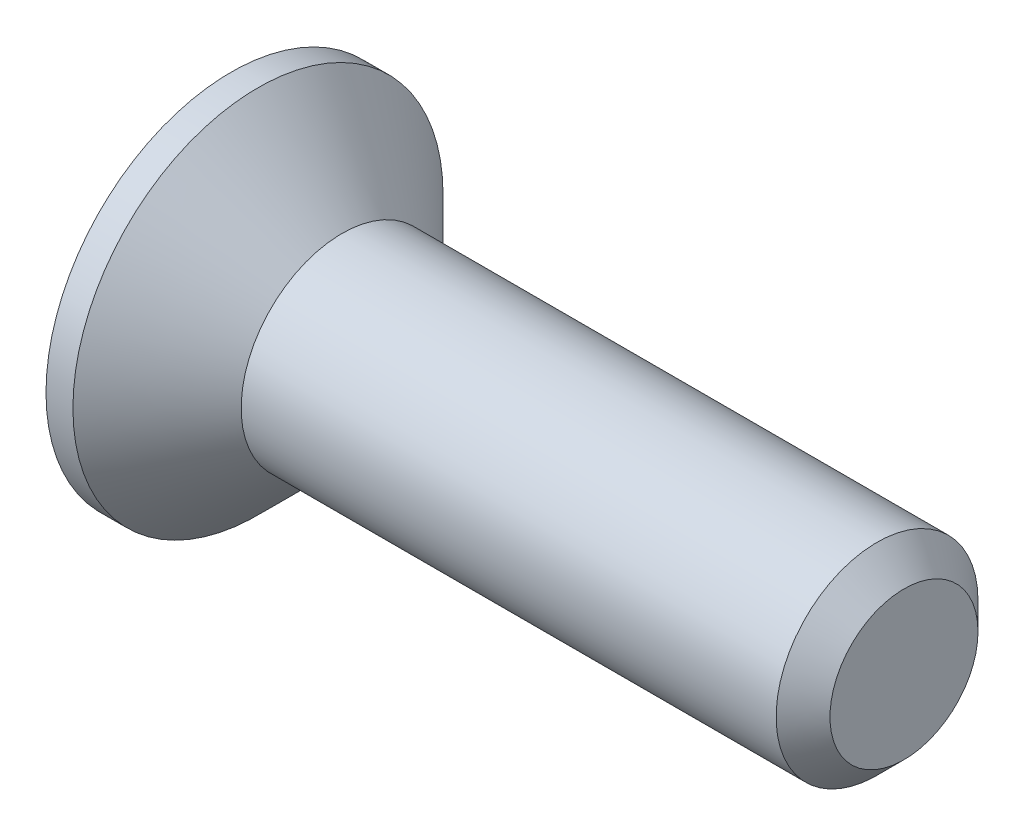
ISO-10303-21;
HEADER;
FILE_DESCRIPTION(('STEP AP214'),'2;1');
FILE_NAME('part.step','',(''),(''),'','','');
FILE_SCHEMA(('AUTOMOTIVE_DESIGN { 1 0 10303 214 1 1 1 1 }'));
ENDSEC;
DATA;
#1=APPLICATION_CONTEXT('core data for automotive mechanical design processes');
#2=APPLICATION_PROTOCOL_DEFINITION('international standard','automotive_design',2000,#1);
#3=PRODUCT_CONTEXT('',#1,'mechanical');
#4=PRODUCT('Part','Part','',(#3));
#5=PRODUCT_RELATED_PRODUCT_CATEGORY('part','',(#4));
#6=PRODUCT_DEFINITION_FORMATION('','',#4);
#7=PRODUCT_DEFINITION_CONTEXT('part definition',#1,'design');
#8=PRODUCT_DEFINITION('design','',#6,#7);
#9=PRODUCT_DEFINITION_SHAPE('','',#8);
#10=(LENGTH_UNIT() NAMED_UNIT(*) SI_UNIT(.MILLI.,.METRE.));
#11=(NAMED_UNIT(*) PLANE_ANGLE_UNIT() SI_UNIT($,.RADIAN.));
#12=(NAMED_UNIT(*) SI_UNIT($,.STERADIAN.) SOLID_ANGLE_UNIT());
#13=UNCERTAINTY_MEASURE_WITH_UNIT(LENGTH_MEASURE(1.E-05),#10,'distance_accuracy_value','');
#14=(GEOMETRIC_REPRESENTATION_CONTEXT(3) GLOBAL_UNCERTAINTY_ASSIGNED_CONTEXT((#13)) GLOBAL_UNIT_ASSIGNED_CONTEXT((#10,
#11,#12)) REPRESENTATION_CONTEXT('',''));
#15=CARTESIAN_POINT('',(0.,0.,0.));
#16=DIRECTION('',(0.,0.,1.));
#17=DIRECTION('',(1.,0.,0.));
#18=AXIS2_PLACEMENT_3D('',#15,#16,#17);
#19=CARTESIAN_POINT('',(48.1847927934104,0.,0.));
#20=DIRECTION('',(1.,0.,0.));
#21=DIRECTION('',(0.,0.,-1.));
#22=AXIS2_PLACEMENT_3D('',#19,#20,#21);
#23=CYLINDRICAL_SURFACE('',#22,1.49999999999999);
#24=CARTESIAN_POINT('',(-4.21273268597435,0.,0.));
#25=DIRECTION('',(1.,0.,0.));
#26=DIRECTION('',(0.,0.,-1.));
#27=AXIS2_PLACEMENT_3D('',#24,#25,#26);
#28=CIRCLE('',#27,1.49999999999999);
#29=CARTESIAN_POINT('',(-4.21273268597435,0.,-1.49999999999999));
#30=VERTEX_POINT('',#29);
#31=EDGE_CURVE('E205',#30,#30,#28,.T.);
#32=ORIENTED_EDGE('',*,*,#31,.T.);
#33=EDGE_LOOP('',(#32));
#34=FACE_BOUND('',#33,.T.);
#35=CARTESIAN_POINT('',(3.73726731402565,0.,0.));
#36=DIRECTION('',(1.,0.,0.));
#37=DIRECTION('',(0.,0.,-1.));
#38=AXIS2_PLACEMENT_3D('',#35,#36,#37);
#39=CIRCLE('',#38,1.49999999999999);
#40=CARTESIAN_POINT('',(3.73726731402565,0.,-1.49999999999999));
#41=VERTEX_POINT('',#40);
#42=EDGE_CURVE('E245',#41,#41,#39,.T.);
#43=ORIENTED_EDGE('',*,*,#42,.F.);
#44=EDGE_LOOP('',(#43));
#45=FACE_BOUND('',#44,.T.);
#46=ADVANCED_FACE('F35',(#34,#45),#23,.T.);
#47=CARTESIAN_POINT('',(4.13726731402565,0.,0.));
#48=DIRECTION('',(-1.,0.,0.));
#49=DIRECTION('',(0.,0.,1.));
#50=AXIS2_PLACEMENT_3D('',#47,#48,#49);
#51=CONICAL_SURFACE('',#50,1.09999999999999,0.785398163397454);
#52=ORIENTED_EDGE('',*,*,#42,.T.);
#53=EDGE_LOOP('',(#52));
#54=FACE_BOUND('',#53,.T.);
#55=CARTESIAN_POINT('',(4.13726731402565,0.,0.));
#56=DIRECTION('',(1.,0.,0.));
#57=DIRECTION('',(0.,0.,-1.));
#58=AXIS2_PLACEMENT_3D('',#55,#56,#57);
#59=CIRCLE('',#58,1.09999999999999);
#60=CARTESIAN_POINT('',(4.13726731402565,0.,-1.09999999999999));
#61=VERTEX_POINT('',#60);
#62=EDGE_CURVE('E242',#61,#61,#59,.T.);
#63=ORIENTED_EDGE('',*,*,#62,.F.);
#64=EDGE_LOOP('',(#63));
#65=FACE_BOUND('',#64,.T.);
#66=ADVANCED_FACE('F417',(#54,#65),#51,.T.);
#67=CARTESIAN_POINT('',(4.13726731402565,1.09999999999999,0.));
#68=DIRECTION('',(1.,0.,0.));
#69=DIRECTION('',(0.,0.,-1.));
#70=AXIS2_PLACEMENT_3D('',#67,#68,#69);
#71=PLANE('',#70);
#72=ORIENTED_EDGE('',*,*,#62,.T.);
#73=EDGE_LOOP('',(#72));
#74=FACE_BOUND('',#73,.T.);
#75=ADVANCED_FACE('F423',(#74),#71,.T.);
#76=CARTESIAN_POINT('',(-5.86273268597435,2.74999999999999,0.));
#77=DIRECTION('',(-1.,0.,0.));
#78=DIRECTION('',(0.,0.,1.));
#79=AXIS2_PLACEMENT_3D('',#76,#77,#78);
#80=PLANE('',#79);
#81=CARTESIAN_POINT('',(-5.86273268597435,-0.552308794936704,0.95662689429756));
#82=DIRECTION('',(-1.,0.,0.));
#83=DIRECTION('',(0.,0.,1.));
#84=AXIS2_PLACEMENT_3D('',#81,#82,#83);
#85=CIRCLE('',#84,0.345382410126592);
#86=CARTESIAN_POINT('',(-5.86273268597435,-0.309423621714401,1.20217892921809));
#87=VERTEX_POINT('',#86);
#88=CARTESIAN_POINT('',(-5.86273268597435,-0.88640568174002,0.86905818154474));
#89=VERTEX_POINT('',#88);
#90=EDGE_CURVE('E266',#87,#89,#85,.F.);
#91=ORIENTED_EDGE('',*,*,#90,.T.);
#92=CARTESIAN_POINT('',(-5.86273268597435,-1.31202848673343,0.757500000000061));
#93=DIRECTION('',(-1.,0.,0.));
#94=DIRECTION('',(0.,0.,1.));
#95=AXIS2_PLACEMENT_3D('',#92,#93,#94);
#96=CIRCLE('',#95,0.439999999999997);
#97=CARTESIAN_POINT('',(-5.86273268597435,-1.19582930345442,0.333120747673377));
#98=VERTEX_POINT('',#97);
#99=EDGE_CURVE('E270',#89,#98,#96,.T.);
#100=ORIENTED_EDGE('',*,*,#99,.T.);
#101=CARTESIAN_POINT('',(-5.86273268597435,-1.10461758987346,0.));
#102=DIRECTION('',(-1.,0.,0.));
#103=DIRECTION('',(0.,0.,1.));
#104=AXIS2_PLACEMENT_3D('',#101,#102,#103);
#105=CIRCLE('',#104,0.345382410126586);
#106=CARTESIAN_POINT('',(-5.86273268597435,-1.19582930345447,-0.333120747673296));
#107=VERTEX_POINT('',#106);
#108=EDGE_CURVE('E268',#98,#107,#105,.F.);
#109=ORIENTED_EDGE('',*,*,#108,.T.);
#110=CARTESIAN_POINT('',(-5.86273268597435,-1.31202848673348,-0.757499999999909));
#111=DIRECTION('',(-1.,0.,0.));
#112=DIRECTION('',(0.,0.,1.));
#113=AXIS2_PLACEMENT_3D('',#110,#111,#112);
#114=CIRCLE('',#113,0.440000000000004);
#115=CARTESIAN_POINT('',(-5.86273268597435,-0.886405681740116,-0.869058181544649));
#116=VERTEX_POINT('',#115);
#117=EDGE_CURVE('E264',#107,#116,#114,.T.);
#118=ORIENTED_EDGE('',*,*,#117,.T.);
#119=CARTESIAN_POINT('',(-5.86273268597435,-0.552308794936798,-0.956626894297446));
#120=DIRECTION('',(-1.,0.,0.));
#121=DIRECTION('',(0.,0.,1.));
#122=AXIS2_PLACEMENT_3D('',#119,#120,#121);
#123=CIRCLE('',#122,0.345382410126588);
#124=CARTESIAN_POINT('',(-5.86273268597435,-0.30942362171449,-1.20217892921801));
#125=VERTEX_POINT('',#124);
#126=EDGE_CURVE('E260',#116,#125,#123,.F.);
#127=ORIENTED_EDGE('',*,*,#126,.T.);
#128=CARTESIAN_POINT('',(-5.86273268597435,-1.05343337566385E-13,-1.51499999999994));
#129=DIRECTION('',(-1.,0.,0.));
#130=DIRECTION('',(0.,0.,1.));
#131=AXIS2_PLACEMENT_3D('',#128,#129,#130);
#132=CIRCLE('',#131,0.440000000000001);
#133=CARTESIAN_POINT('',(-5.86273268597435,0.309423621714345,-1.20217892921803));
#134=VERTEX_POINT('',#133);
#135=EDGE_CURVE('E256',#125,#134,#132,.T.);
#136=ORIENTED_EDGE('',*,*,#135,.T.);
#137=CARTESIAN_POINT('',(-5.86273268597435,0.552308794936677,-0.956626894297546));
#138=DIRECTION('',(-1.,0.,0.));
#139=DIRECTION('',(0.,0.,1.));
#140=AXIS2_PLACEMENT_3D('',#137,#138,#139);
#141=CIRCLE('',#140,0.34538241012656);
#142=CARTESIAN_POINT('',(-5.86273268597435,0.886405681739925,-0.869058181544674));
#143=VERTEX_POINT('',#142);
#144=EDGE_CURVE('E252',#134,#143,#141,.F.);
#145=ORIENTED_EDGE('',*,*,#144,.T.);
#146=CARTESIAN_POINT('',(-5.86273268597435,1.31202848673332,-0.757500000000001));
#147=DIRECTION('',(-1.,0.,0.));
#148=DIRECTION('',(0.,0.,1.));
#149=AXIS2_PLACEMENT_3D('',#146,#147,#148);
#150=CIRCLE('',#149,0.44);
#151=CARTESIAN_POINT('',(-5.86273268597435,1.19582930345433,-0.333120747673387));
#152=VERTEX_POINT('',#151);
#153=EDGE_CURVE('E248',#143,#152,#150,.T.);
#154=ORIENTED_EDGE('',*,*,#153,.T.);
#155=CARTESIAN_POINT('',(-5.86273268597435,1.10461758987334,0.));
#156=DIRECTION('',(-1.,0.,0.));
#157=DIRECTION('',(0.,0.,1.));
#158=AXIS2_PLACEMENT_3D('',#155,#156,#157);
#159=CIRCLE('',#158,0.345382410126588);
#160=CARTESIAN_POINT('',(-5.86273268597435,1.19582930345436,0.333120747673347));
#161=VERTEX_POINT('',#160);
#162=EDGE_CURVE('E250',#152,#161,#159,.F.);
#163=ORIENTED_EDGE('',*,*,#162,.T.);
#164=CARTESIAN_POINT('',(-5.86273268597435,1.31202848673337,0.757499999999969));
#165=DIRECTION('',(-1.,0.,0.));
#166=DIRECTION('',(0.,0.,1.));
#167=AXIS2_PLACEMENT_3D('',#164,#165,#166);
#168=CIRCLE('',#167,0.439999999999988);
#169=CARTESIAN_POINT('',(-5.86273268597435,0.886405681739998,0.869058181544673));
#170=VERTEX_POINT('',#169);
#171=EDGE_CURVE('E254',#161,#170,#168,.T.);
#172=ORIENTED_EDGE('',*,*,#171,.T.);
#173=CARTESIAN_POINT('',(-5.86273268597435,0.552308794936693,0.956626894297506));
#174=DIRECTION('',(-1.,0.,0.));
#175=DIRECTION('',(0.,0.,1.));
#176=AXIS2_PLACEMENT_3D('',#173,#174,#175);
#177=CIRCLE('',#176,0.3453824101266);
#178=CARTESIAN_POINT('',(-5.86273268597435,0.309423621714385,1.20217892921807));
#179=VERTEX_POINT('',#178);
#180=EDGE_CURVE('E258',#170,#179,#177,.F.);
#181=ORIENTED_EDGE('',*,*,#180,.T.);
#182=CARTESIAN_POINT('',(-5.86273268597435,0.,1.515));
#183=DIRECTION('',(-1.,0.,0.));
#184=DIRECTION('',(0.,0.,1.));
#185=AXIS2_PLACEMENT_3D('',#182,#183,#184);
#186=CIRCLE('',#185,0.439999999999998);
#187=EDGE_CURVE('E262',#179,#87,#186,.T.);
#188=ORIENTED_EDGE('',*,*,#187,.T.);
#189=EDGE_LOOP('',(#91,#100,#109,#118,#127,#136,#145,#154,#163,#172,#181,#188));
#190=FACE_BOUND('',#189,.T.);
#191=CARTESIAN_POINT('',(-5.86273268597435,0.,0.));
#192=DIRECTION('',(1.,0.,0.));
#193=DIRECTION('',(0.,0.,-1.));
#194=AXIS2_PLACEMENT_3D('',#191,#192,#193);
#195=CIRCLE('',#194,2.74999999999999);
#196=CARTESIAN_POINT('',(-5.86273268597435,0.,-2.74999999999999));
#197=VERTEX_POINT('',#196);
#198=EDGE_CURVE('E239',#197,#197,#195,.T.);
#199=ORIENTED_EDGE('',*,*,#198,.F.);
#200=EDGE_LOOP('',(#199));
#201=FACE_BOUND('',#200,.T.);
#202=ADVANCED_FACE('F334',(#190,#201),#80,.T.);
#203=CARTESIAN_POINT('',(48.1847927934104,0.,0.));
#204=DIRECTION('',(1.,0.,0.));
#205=DIRECTION('',(0.,0.,-1.));
#206=AXIS2_PLACEMENT_3D('',#203,#204,#205);
#207=CYLINDRICAL_SURFACE('',#206,2.74999999999999);
#208=ORIENTED_EDGE('',*,*,#198,.T.);
#209=EDGE_LOOP('',(#208));
#210=FACE_BOUND('',#209,.T.);
#211=CARTESIAN_POINT('',(-5.46273268597437,0.,0.));
#212=DIRECTION('',(1.,0.,0.));
#213=DIRECTION('',(0.,0.,-1.));
#214=AXIS2_PLACEMENT_3D('',#211,#212,#213);
#215=CIRCLE('',#214,2.74999999999999);
#216=CARTESIAN_POINT('',(-5.46273268597437,0.,-2.74999999999999));
#217=VERTEX_POINT('',#216);
#218=EDGE_CURVE('E236',#217,#217,#215,.T.);
#219=ORIENTED_EDGE('',*,*,#218,.F.);
#220=EDGE_LOOP('',(#219));
#221=FACE_BOUND('',#220,.T.);
#222=ADVANCED_FACE('F654',(#210,#221),#207,.T.);
#223=CARTESIAN_POINT('',(-4.21273268597435,0.,0.));
#224=DIRECTION('',(-1.,0.,0.));
#225=DIRECTION('',(0.,0.,1.));
#226=AXIS2_PLACEMENT_3D('',#223,#224,#225);
#227=CONICAL_SURFACE('',#226,1.49999999999999,0.785398163397442);
#228=ORIENTED_EDGE('',*,*,#218,.T.);
#229=EDGE_LOOP('',(#228));
#230=FACE_BOUND('',#229,.T.);
#231=ORIENTED_EDGE('',*,*,#31,.F.);
#232=EDGE_LOOP('',(#231));
#233=FACE_BOUND('',#232,.T.);
#234=ADVANCED_FACE('F647',(#230,#233),#227,.T.);
#235=CARTESIAN_POINT('',(-5.03273268597435,1.10461758987334,0.));
#236=DIRECTION('',(-1.,0.,0.));
#237=DIRECTION('',(0.,0.,1.));
#238=AXIS2_PLACEMENT_3D('',#235,#236,#237);
#239=CYLINDRICAL_SURFACE('',#238,0.295382410126597);
#240=DIRECTION('',(-1.,0.,0.));
#241=VECTOR('',#240,1.);
#242=CARTESIAN_POINT('',(-5.03273268597435,1.18262485080903,0.284895832636267));
#243=LINE('',#242,#241);
#244=CARTESIAN_POINT('',(-5.03273268597435,1.18262485080903,0.284895832636267));
#245=VERTEX_POINT('',#244);
#246=CARTESIAN_POINT('',(-5.81273268597436,1.18262485080903,0.284895832636267));
#247=VERTEX_POINT('',#246);
#248=EDGE_CURVE('E203',#245,#247,#243,.T.);
#249=ORIENTED_EDGE('',*,*,#248,.T.);
#250=CARTESIAN_POINT('',(-5.81273268597436,1.10461758987334,0.));
#251=DIRECTION('',(-1.,0.,0.));
#252=DIRECTION('',(0.,0.,1.));
#253=AXIS2_PLACEMENT_3D('',#250,#251,#252);
#254=CIRCLE('',#253,0.295382410126597);
#255=CARTESIAN_POINT('',(-5.81273268597436,1.182624850809,-0.28489583263628));
#256=VERTEX_POINT('',#255);
#257=EDGE_CURVE('E45',#247,#256,#254,.T.);
#258=ORIENTED_EDGE('',*,*,#257,.T.);
#259=DIRECTION('',(-1.,0.,0.));
#260=VECTOR('',#259,1.);
#261=CARTESIAN_POINT('',(-5.03273268597435,1.182624850809,-0.28489583263628));
#262=LINE('',#261,#260);
#263=CARTESIAN_POINT('',(-5.03273268597435,1.182624850809,-0.28489583263628));
#264=VERTEX_POINT('',#263);
#265=EDGE_CURVE('E162',#264,#256,#262,.T.);
#266=ORIENTED_EDGE('',*,*,#265,.F.);
#267=CARTESIAN_POINT('',(-5.03273268597435,1.10461758987334,0.));
#268=DIRECTION('',(-1.,0.,0.));
#269=DIRECTION('',(0.,0.,1.));
#270=AXIS2_PLACEMENT_3D('',#267,#268,#269);
#271=CIRCLE('',#270,0.295382410126597);
#272=EDGE_CURVE('E169',#245,#264,#271,.T.);
#273=ORIENTED_EDGE('',*,*,#272,.F.);
#274=EDGE_LOOP('',(#249,#258,#266,#273));
#275=FACE_BOUND('',#274,.T.);
#276=ADVANCED_FACE('F172',(#275),#239,.F.);
#277=CARTESIAN_POINT('',(-5.03273268597435,1.31202848673337,0.757499999999969));
#278=DIRECTION('',(-1.,0.,0.));
#279=DIRECTION('',(0.,0.,1.));
#280=AXIS2_PLACEMENT_3D('',#277,#278,#279);
#281=CYLINDRICAL_SURFACE('',#280,0.489999999999979);
#282=DIRECTION('',(-1.,0.,0.));
#283=VECTOR('',#282,1.);
#284=CARTESIAN_POINT('',(-5.03273268597435,0.838039453899849,0.881735247629296));
#285=LINE('',#284,#283);
#286=CARTESIAN_POINT('',(-5.03273268597435,0.838039453899849,0.881735247629296));
#287=VERTEX_POINT('',#286);
#288=CARTESIAN_POINT('',(-5.81273268597436,0.838039453899849,0.881735247629296));
#289=VERTEX_POINT('',#288);
#290=EDGE_CURVE('E206',#287,#289,#285,.T.);
#291=ORIENTED_EDGE('',*,*,#290,.T.);
#292=CARTESIAN_POINT('',(-5.81273268597436,1.31202848673337,0.757499999999969));
#293=DIRECTION('',(-1.,0.,0.));
#294=DIRECTION('',(0.,0.,1.));
#295=AXIS2_PLACEMENT_3D('',#292,#293,#294);
#296=CIRCLE('',#295,0.489999999999979);
#297=EDGE_CURVE('E290',#289,#247,#296,.F.);
#298=ORIENTED_EDGE('',*,*,#297,.T.);
#299=ORIENTED_EDGE('',*,*,#248,.F.);
#300=CARTESIAN_POINT('',(-5.03273268597435,1.31202848673337,0.757499999999969));
#301=DIRECTION('',(-1.,0.,0.));
#302=DIRECTION('',(0.,0.,1.));
#303=AXIS2_PLACEMENT_3D('',#300,#301,#302);
#304=CIRCLE('',#303,0.489999999999979);
#305=EDGE_CURVE('E173',#245,#287,#304,.T.);
#306=ORIENTED_EDGE('',*,*,#305,.T.);
#307=EDGE_LOOP('',(#291,#298,#299,#306));
#308=FACE_BOUND('',#307,.T.);
#309=ADVANCED_FACE('F403',(#308),#281,.T.);
#310=CARTESIAN_POINT('',(-5.03273268597435,0.552308794936693,0.956626894297506));
#311=DIRECTION('',(-1.,0.,0.));
#312=DIRECTION('',(0.,0.,1.));
#313=AXIS2_PLACEMENT_3D('',#310,#311,#312);
#314=CYLINDRICAL_SURFACE('',#313,0.295382410126609);
#315=DIRECTION('',(-1.,0.,0.));
#316=VECTOR('',#315,1.);
#317=CARTESIAN_POINT('',(-5.03273268597435,0.344585396909195,1.16663108026558));
#318=LINE('',#317,#316);
#319=CARTESIAN_POINT('',(-5.03273268597435,0.344585396909195,1.16663108026558));
#320=VERTEX_POINT('',#319);
#321=CARTESIAN_POINT('',(-5.81273268597436,0.344585396909195,1.16663108026558));
#322=VERTEX_POINT('',#321);
#323=EDGE_CURVE('E209',#320,#322,#318,.T.);
#324=ORIENTED_EDGE('',*,*,#323,.T.);
#325=CARTESIAN_POINT('',(-5.81273268597436,0.552308794936693,0.956626894297506));
#326=DIRECTION('',(-1.,0.,0.));
#327=DIRECTION('',(0.,0.,1.));
#328=AXIS2_PLACEMENT_3D('',#325,#326,#327);
#329=CIRCLE('',#328,0.295382410126609);
#330=EDGE_CURVE('E286',#322,#289,#329,.T.);
#331=ORIENTED_EDGE('',*,*,#330,.T.);
#332=ORIENTED_EDGE('',*,*,#290,.F.);
#333=CARTESIAN_POINT('',(-5.03273268597435,0.552308794936693,0.956626894297506));
#334=DIRECTION('',(-1.,0.,0.));
#335=DIRECTION('',(0.,0.,1.));
#336=AXIS2_PLACEMENT_3D('',#333,#334,#335);
#337=CIRCLE('',#336,0.295382410126609);
#338=EDGE_CURVE('E200',#320,#287,#337,.T.);
#339=ORIENTED_EDGE('',*,*,#338,.F.);
#340=EDGE_LOOP('',(#324,#331,#332,#339));
#341=FACE_BOUND('',#340,.T.);
#342=ADVANCED_FACE('F399',(#341),#314,.F.);
#343=CARTESIAN_POINT('',(-5.03273268597435,0.,1.515));
#344=DIRECTION('',(-1.,0.,0.));
#345=DIRECTION('',(0.,0.,1.));
#346=AXIS2_PLACEMENT_3D('',#343,#344,#345);
#347=CYLINDRICAL_SURFACE('',#346,0.489999999999989);
#348=DIRECTION('',(-1.,0.,0.));
#349=VECTOR('',#348,1.);
#350=CARTESIAN_POINT('',(-5.03273268597435,-0.344585396909213,1.1666310802656));
#351=LINE('',#350,#349);
#352=CARTESIAN_POINT('',(-5.03273268597435,-0.344585396909213,1.1666310802656));
#353=VERTEX_POINT('',#352);
#354=CARTESIAN_POINT('',(-5.81273268597436,-0.344585396909213,1.1666310802656));
#355=VERTEX_POINT('',#354);
#356=EDGE_CURVE('E212',#353,#355,#351,.T.);
#357=ORIENTED_EDGE('',*,*,#356,.T.);
#358=CARTESIAN_POINT('',(-5.81273268597436,0.,1.515));
#359=DIRECTION('',(-1.,0.,0.));
#360=DIRECTION('',(0.,0.,1.));
#361=AXIS2_PLACEMENT_3D('',#358,#359,#360);
#362=CIRCLE('',#361,0.489999999999989);
#363=EDGE_CURVE('E282',#355,#322,#362,.F.);
#364=ORIENTED_EDGE('',*,*,#363,.T.);
#365=ORIENTED_EDGE('',*,*,#323,.F.);
#366=CARTESIAN_POINT('',(-5.03273268597435,0.,1.515));
#367=DIRECTION('',(-1.,0.,0.));
#368=DIRECTION('',(0.,0.,1.));
#369=AXIS2_PLACEMENT_3D('',#366,#367,#368);
#370=CIRCLE('',#369,0.489999999999989);
#371=EDGE_CURVE('E198',#320,#353,#370,.T.);
#372=ORIENTED_EDGE('',*,*,#371,.T.);
#373=EDGE_LOOP('',(#357,#364,#365,#372));
#374=FACE_BOUND('',#373,.T.);
#375=ADVANCED_FACE('F387',(#374),#347,.T.);
#376=CARTESIAN_POINT('',(-5.03273268597435,-0.552308794936704,0.95662689429756));
#377=DIRECTION('',(-1.,0.,0.));
#378=DIRECTION('',(0.,0.,1.));
#379=AXIS2_PLACEMENT_3D('',#376,#377,#378);
#380=CYLINDRICAL_SURFACE('',#379,0.295382410126601);
#381=DIRECTION('',(-1.,0.,0.));
#382=VECTOR('',#381,1.);
#383=CARTESIAN_POINT('',(-5.03273268597435,-0.83803945389987,0.881735247629361));
#384=LINE('',#383,#382);
#385=CARTESIAN_POINT('',(-5.03273268597435,-0.83803945389987,0.881735247629361));
#386=VERTEX_POINT('',#385);
#387=CARTESIAN_POINT('',(-5.81273268597436,-0.83803945389987,0.881735247629361));
#388=VERTEX_POINT('',#387);
#389=EDGE_CURVE('E215',#386,#388,#384,.T.);
#390=ORIENTED_EDGE('',*,*,#389,.T.);
#391=CARTESIAN_POINT('',(-5.81273268597436,-0.552308794936704,0.95662689429756));
#392=DIRECTION('',(-1.,0.,0.));
#393=DIRECTION('',(0.,0.,1.));
#394=AXIS2_PLACEMENT_3D('',#391,#392,#393);
#395=CIRCLE('',#394,0.295382410126601);
#396=EDGE_CURVE('E278',#388,#355,#395,.T.);
#397=ORIENTED_EDGE('',*,*,#396,.T.);
#398=ORIENTED_EDGE('',*,*,#356,.F.);
#399=CARTESIAN_POINT('',(-5.03273268597435,-0.552308794936704,0.95662689429756));
#400=DIRECTION('',(-1.,0.,0.));
#401=DIRECTION('',(0.,0.,1.));
#402=AXIS2_PLACEMENT_3D('',#399,#400,#401);
#403=CIRCLE('',#402,0.295382410126601);
#404=EDGE_CURVE('E195',#386,#353,#403,.T.);
#405=ORIENTED_EDGE('',*,*,#404,.F.);
#406=EDGE_LOOP('',(#390,#397,#398,#405));
#407=FACE_BOUND('',#406,.T.);
#408=ADVANCED_FACE('F383',(#407),#380,.F.);
#409=CARTESIAN_POINT('',(-5.03273268597435,-1.31202848673343,0.757500000000061));
#410=DIRECTION('',(-1.,0.,0.));
#411=DIRECTION('',(0.,0.,1.));
#412=AXIS2_PLACEMENT_3D('',#409,#410,#411);
#413=CYLINDRICAL_SURFACE('',#412,0.489999999999988);
#414=DIRECTION('',(-1.,0.,0.));
#415=VECTOR('',#414,1.);
#416=CARTESIAN_POINT('',(-5.03273268597435,-1.1826248508091,0.284895832636342));
#417=LINE('',#416,#415);
#418=CARTESIAN_POINT('',(-5.03273268597435,-1.1826248508091,0.284895832636342));
#419=VERTEX_POINT('',#418);
#420=CARTESIAN_POINT('',(-5.81273268597436,-1.1826248508091,0.284895832636342));
#421=VERTEX_POINT('',#420);
#422=EDGE_CURVE('E218',#419,#421,#417,.T.);
#423=ORIENTED_EDGE('',*,*,#422,.T.);
#424=CARTESIAN_POINT('',(-5.81273268597436,-1.31202848673343,0.757500000000061));
#425=DIRECTION('',(-1.,0.,0.));
#426=DIRECTION('',(0.,0.,1.));
#427=AXIS2_PLACEMENT_3D('',#424,#425,#426);
#428=CIRCLE('',#427,0.489999999999988);
#429=EDGE_CURVE('E273',#421,#388,#428,.F.);
#430=ORIENTED_EDGE('',*,*,#429,.T.);
#431=ORIENTED_EDGE('',*,*,#389,.F.);
#432=CARTESIAN_POINT('',(-5.03273268597435,-1.31202848673343,0.757500000000061));
#433=DIRECTION('',(-1.,0.,0.));
#434=DIRECTION('',(0.,0.,1.));
#435=AXIS2_PLACEMENT_3D('',#432,#433,#434);
#436=CIRCLE('',#435,0.489999999999988);
#437=EDGE_CURVE('E193',#386,#419,#436,.T.);
#438=ORIENTED_EDGE('',*,*,#437,.T.);
#439=EDGE_LOOP('',(#423,#430,#431,#438));
#440=FACE_BOUND('',#439,.T.);
#441=ADVANCED_FACE('F365',(#440),#413,.T.);
#442=CARTESIAN_POINT('',(-5.03273268597435,-1.10461758987346,0.));
#443=DIRECTION('',(-1.,0.,0.));
#444=DIRECTION('',(0.,0.,1.));
#445=AXIS2_PLACEMENT_3D('',#442,#443,#444);
#446=CYLINDRICAL_SURFACE('',#445,0.295382410126595);
#447=DIRECTION('',(-1.,0.,0.));
#448=VECTOR('',#447,1.);
#449=CARTESIAN_POINT('',(-5.03273268597435,-1.18262485080915,-0.284895832636267));
#450=LINE('',#449,#448);
#451=CARTESIAN_POINT('',(-5.03273268597435,-1.18262485080915,-0.284895832636267));
#452=VERTEX_POINT('',#451);
#453=CARTESIAN_POINT('',(-5.81273268597436,-1.18262485080915,-0.284895832636267));
#454=VERTEX_POINT('',#453);
#455=EDGE_CURVE('E221',#452,#454,#450,.T.);
#456=ORIENTED_EDGE('',*,*,#455,.T.);
#457=CARTESIAN_POINT('',(-5.81273268597436,-1.10461758987346,0.));
#458=DIRECTION('',(-1.,0.,0.));
#459=DIRECTION('',(0.,0.,1.));
#460=AXIS2_PLACEMENT_3D('',#457,#458,#459);
#461=CIRCLE('',#460,0.295382410126595);
#462=EDGE_CURVE('E276',#454,#421,#461,.T.);
#463=ORIENTED_EDGE('',*,*,#462,.T.);
#464=ORIENTED_EDGE('',*,*,#422,.F.);
#465=CARTESIAN_POINT('',(-5.03273268597435,-1.10461758987346,0.));
#466=DIRECTION('',(-1.,0.,0.));
#467=DIRECTION('',(0.,0.,1.));
#468=AXIS2_PLACEMENT_3D('',#465,#466,#467);
#469=CIRCLE('',#468,0.295382410126595);
#470=EDGE_CURVE('E190',#452,#419,#469,.T.);
#471=ORIENTED_EDGE('',*,*,#470,.F.);
#472=EDGE_LOOP('',(#456,#463,#464,#471));
#473=FACE_BOUND('',#472,.T.);
#474=ADVANCED_FACE('F360',(#473),#446,.F.);
#475=CARTESIAN_POINT('',(-5.03273268597435,-1.31202848673348,-0.757499999999909));
#476=DIRECTION('',(-1.,0.,0.));
#477=DIRECTION('',(0.,0.,1.));
#478=AXIS2_PLACEMENT_3D('',#475,#476,#477);
#479=CYLINDRICAL_SURFACE('',#478,0.489999999999996);
#480=DIRECTION('',(-1.,0.,0.));
#481=VECTOR('',#480,1.);
#482=CARTESIAN_POINT('',(-5.03273268597435,-0.838039453899949,-0.881735247629281));
#483=LINE('',#482,#481);
#484=CARTESIAN_POINT('',(-5.03273268597435,-0.838039453899949,-0.881735247629281));
#485=VERTEX_POINT('',#484);
#486=CARTESIAN_POINT('',(-5.81273268597436,-0.838039453899949,-0.881735247629281));
#487=VERTEX_POINT('',#486);
#488=EDGE_CURVE('E224',#485,#487,#483,.T.);
#489=ORIENTED_EDGE('',*,*,#488,.T.);
#490=CARTESIAN_POINT('',(-5.81273268597436,-1.31202848673348,-0.757499999999909));
#491=DIRECTION('',(-1.,0.,0.));
#492=DIRECTION('',(0.,0.,1.));
#493=AXIS2_PLACEMENT_3D('',#490,#491,#492);
#494=CIRCLE('',#493,0.489999999999996);
#495=EDGE_CURVE('E280',#487,#454,#494,.F.);
#496=ORIENTED_EDGE('',*,*,#495,.T.);
#497=ORIENTED_EDGE('',*,*,#455,.F.);
#498=CARTESIAN_POINT('',(-5.03273268597435,-1.31202848673348,-0.757499999999909));
#499=DIRECTION('',(-1.,0.,0.));
#500=DIRECTION('',(0.,0.,1.));
#501=AXIS2_PLACEMENT_3D('',#498,#499,#500);
#502=CIRCLE('',#501,0.489999999999996);
#503=EDGE_CURVE('E188',#452,#485,#502,.T.);
#504=ORIENTED_EDGE('',*,*,#503,.T.);
#505=EDGE_LOOP('',(#489,#496,#497,#504));
#506=FACE_BOUND('',#505,.T.);
#507=ADVANCED_FACE('F353',(#506),#479,.T.);
#508=CARTESIAN_POINT('',(-5.03273268597435,-0.552308794936798,-0.956626894297446));
#509=DIRECTION('',(-1.,0.,0.));
#510=DIRECTION('',(0.,0.,1.));
#511=AXIS2_PLACEMENT_3D('',#508,#509,#510);
#512=CYLINDRICAL_SURFACE('',#511,0.295382410126597);
#513=DIRECTION('',(-1.,0.,0.));
#514=VECTOR('',#513,1.);
#515=CARTESIAN_POINT('',(-5.03273268597435,-0.344585396909309,-1.16663108026551));
#516=LINE('',#515,#514);
#517=CARTESIAN_POINT('',(-5.03273268597435,-0.344585396909309,-1.16663108026551));
#518=VERTEX_POINT('',#517);
#519=CARTESIAN_POINT('',(-5.81273268597436,-0.344585396909309,-1.16663108026551));
#520=VERTEX_POINT('',#519);
#521=EDGE_CURVE('E227',#518,#520,#516,.T.);
#522=ORIENTED_EDGE('',*,*,#521,.T.);
#523=CARTESIAN_POINT('',(-5.81273268597436,-0.552308794936798,-0.956626894297446));
#524=DIRECTION('',(-1.,0.,0.));
#525=DIRECTION('',(0.,0.,1.));
#526=AXIS2_PLACEMENT_3D('',#523,#524,#525);
#527=CIRCLE('',#526,0.295382410126597);
#528=EDGE_CURVE('E284',#520,#487,#527,.T.);
#529=ORIENTED_EDGE('',*,*,#528,.T.);
#530=ORIENTED_EDGE('',*,*,#488,.F.);
#531=CARTESIAN_POINT('',(-5.03273268597435,-0.552308794936798,-0.956626894297446));
#532=DIRECTION('',(-1.,0.,0.));
#533=DIRECTION('',(0.,0.,1.));
#534=AXIS2_PLACEMENT_3D('',#531,#532,#533);
#535=CIRCLE('',#534,0.295382410126597);
#536=EDGE_CURVE('E185',#518,#485,#535,.T.);
#537=ORIENTED_EDGE('',*,*,#536,.F.);
#538=EDGE_LOOP('',(#522,#529,#530,#537));
#539=FACE_BOUND('',#538,.T.);
#540=ADVANCED_FACE('F350',(#539),#512,.F.);
#541=CARTESIAN_POINT('',(-5.03273268597435,-1.05343337566385E-13,-1.51499999999994));
#542=DIRECTION('',(-1.,0.,0.));
#543=DIRECTION('',(0.,0.,1.));
#544=AXIS2_PLACEMENT_3D('',#541,#542,#543);
#545=CYLINDRICAL_SURFACE('',#544,0.489999999999992);
#546=DIRECTION('',(-1.,0.,0.));
#547=VECTOR('',#546,1.);
#548=CARTESIAN_POINT('',(-5.03273268597435,0.344585396909137,-1.16663108026557));
#549=LINE('',#548,#547);
#550=CARTESIAN_POINT('',(-5.03273268597435,0.344585396909137,-1.16663108026557));
#551=VERTEX_POINT('',#550);
#552=CARTESIAN_POINT('',(-5.81273268597436,0.344585396909137,-1.16663108026557));
#553=VERTEX_POINT('',#552);
#554=EDGE_CURVE('E230',#551,#553,#549,.T.);
#555=ORIENTED_EDGE('',*,*,#554,.T.);
#556=CARTESIAN_POINT('',(-5.81273268597436,-1.05343337566385E-13,-1.51499999999994));
#557=DIRECTION('',(-1.,0.,0.));
#558=DIRECTION('',(0.,0.,1.));
#559=AXIS2_PLACEMENT_3D('',#556,#557,#558);
#560=CIRCLE('',#559,0.489999999999992);
#561=EDGE_CURVE('E288',#553,#520,#560,.F.);
#562=ORIENTED_EDGE('',*,*,#561,.T.);
#563=ORIENTED_EDGE('',*,*,#521,.F.);
#564=CARTESIAN_POINT('',(-5.03273268597435,-1.05343337566385E-13,-1.51499999999994));
#565=DIRECTION('',(-1.,0.,0.));
#566=DIRECTION('',(0.,0.,1.));
#567=AXIS2_PLACEMENT_3D('',#564,#565,#566);
#568=CIRCLE('',#567,0.489999999999992);
#569=EDGE_CURVE('E183',#518,#551,#568,.T.);
#570=ORIENTED_EDGE('',*,*,#569,.T.);
#571=EDGE_LOOP('',(#555,#562,#563,#570));
#572=FACE_BOUND('',#571,.T.);
#573=ADVANCED_FACE('F574',(#572),#545,.T.);
#574=CARTESIAN_POINT('',(-5.03273268597435,0.552308794936677,-0.956626894297546));
#575=DIRECTION('',(-1.,0.,0.));
#576=DIRECTION('',(0.,0.,1.));
#577=AXIS2_PLACEMENT_3D('',#574,#575,#576);
#578=CYLINDRICAL_SURFACE('',#577,0.295382410126569);
#579=DIRECTION('',(-1.,0.,0.));
#580=VECTOR('',#579,1.);
#581=CARTESIAN_POINT('',(-5.03273268597435,0.838039453899797,-0.881735247629298));
#582=LINE('',#581,#580);
#583=CARTESIAN_POINT('',(-5.03273268597435,0.838039453899797,-0.881735247629298));
#584=VERTEX_POINT('',#583);
#585=CARTESIAN_POINT('',(-5.81273268597436,0.838039453899797,-0.881735247629298));
#586=VERTEX_POINT('',#585);
#587=EDGE_CURVE('E163',#584,#586,#582,.T.);
#588=ORIENTED_EDGE('',*,*,#587,.T.);
#589=CARTESIAN_POINT('',(-5.81273268597436,0.552308794936677,-0.956626894297546));
#590=DIRECTION('',(-1.,0.,0.));
#591=DIRECTION('',(0.,0.,1.));
#592=AXIS2_PLACEMENT_3D('',#589,#590,#591);
#593=CIRCLE('',#592,0.295382410126569);
#594=EDGE_CURVE('E292',#586,#553,#593,.T.);
#595=ORIENTED_EDGE('',*,*,#594,.T.);
#596=ORIENTED_EDGE('',*,*,#554,.F.);
#597=CARTESIAN_POINT('',(-5.03273268597435,0.552308794936677,-0.956626894297546));
#598=DIRECTION('',(-1.,0.,0.));
#599=DIRECTION('',(0.,0.,1.));
#600=AXIS2_PLACEMENT_3D('',#597,#598,#599);
#601=CIRCLE('',#600,0.295382410126569);
#602=EDGE_CURVE('E168',#584,#551,#601,.T.);
#603=ORIENTED_EDGE('',*,*,#602,.F.);
#604=EDGE_LOOP('',(#588,#595,#596,#603));
#605=FACE_BOUND('',#604,.T.);
#606=ADVANCED_FACE('F566',(#605),#578,.F.);
#607=CARTESIAN_POINT('',(-5.03273268597435,1.31202848673332,-0.757500000000001));
#608=DIRECTION('',(-1.,0.,0.));
#609=DIRECTION('',(0.,0.,1.));
#610=AXIS2_PLACEMENT_3D('',#607,#608,#609);
#611=CYLINDRICAL_SURFACE('',#610,0.489999999999991);
#612=ORIENTED_EDGE('',*,*,#265,.T.);
#613=CARTESIAN_POINT('',(-5.81273268597436,1.31202848673332,-0.757500000000001));
#614=DIRECTION('',(-1.,0.,0.));
#615=DIRECTION('',(0.,0.,1.));
#616=AXIS2_PLACEMENT_3D('',#613,#614,#615);
#617=CIRCLE('',#616,0.489999999999991);
#618=EDGE_CURVE('E11',#256,#586,#617,.F.);
#619=ORIENTED_EDGE('',*,*,#618,.T.);
#620=ORIENTED_EDGE('',*,*,#587,.F.);
#621=CARTESIAN_POINT('',(-5.03273268597435,1.31202848673332,-0.757500000000001));
#622=DIRECTION('',(-1.,0.,0.));
#623=DIRECTION('',(0.,0.,1.));
#624=AXIS2_PLACEMENT_3D('',#621,#622,#623);
#625=CIRCLE('',#624,0.489999999999991);
#626=EDGE_CURVE('E160',#584,#264,#625,.T.);
#627=ORIENTED_EDGE('',*,*,#626,.T.);
#628=EDGE_LOOP('',(#612,#619,#620,#627));
#629=FACE_BOUND('',#628,.T.);
#630=ADVANCED_FACE('F161',(#629),#611,.T.);
#631=CARTESIAN_POINT('',(-5.03273268597435,1.20832303830333,-0.378750000000013));
#632=DIRECTION('',(-1.,0.,0.));
#633=DIRECTION('',(0.,0.,1.));
#634=AXIS2_PLACEMENT_3D('',#631,#632,#633);
#635=PLANE('',#634);
#636=ORIENTED_EDGE('',*,*,#272,.T.);
#637=ORIENTED_EDGE('',*,*,#626,.F.);
#638=ORIENTED_EDGE('',*,*,#602,.T.);
#639=ORIENTED_EDGE('',*,*,#569,.F.);
#640=ORIENTED_EDGE('',*,*,#536,.T.);
#641=ORIENTED_EDGE('',*,*,#503,.F.);
#642=ORIENTED_EDGE('',*,*,#470,.T.);
#643=ORIENTED_EDGE('',*,*,#437,.F.);
#644=ORIENTED_EDGE('',*,*,#404,.T.);
#645=ORIENTED_EDGE('',*,*,#371,.F.);
#646=ORIENTED_EDGE('',*,*,#338,.T.);
#647=ORIENTED_EDGE('',*,*,#305,.F.);
#648=EDGE_LOOP('',(#636,#637,#638,#639,#640,#641,#642,#643,#644,#645,#646,#647));
#649=FACE_BOUND('',#648,.T.);
#650=ADVANCED_FACE('F176',(#649),#635,.T.);
#651=CARTESIAN_POINT('',(-5.86273268597435,1.31202848673332,-0.757500000000001));
#652=DIRECTION('',(1.,0.,0.));
#653=DIRECTION('',(0.,0.,-1.));
#654=AXIS2_PLACEMENT_3D('',#651,#652,#653);
#655=CONICAL_SURFACE('',#654,0.44,0.785398163397449);
#656=DIRECTION('',(-0.707106781186547,0.684001753723757,0.179280787879867));
#657=VECTOR('',#656,1.);
#658=CARTESIAN_POINT('',(-5.81273268597436,0.838039453899777,-0.881735247629304));
#659=LINE('',#658,#657);
#660=EDGE_CURVE('E180',#586,#143,#659,.T.);
#661=ORIENTED_EDGE('',*,*,#660,.F.);
#662=ORIENTED_EDGE('',*,*,#618,.F.);
#663=DIRECTION('',(0.707106781186547,-0.186739160147522,0.682003288897787));
#664=VECTOR('',#663,1.);
#665=CARTESIAN_POINT('',(-5.86273268597435,1.19582930345433,-0.333120747673387));
#666=LINE('',#665,#664);
#667=EDGE_CURVE('E40',#152,#256,#666,.T.);
#668=ORIENTED_EDGE('',*,*,#667,.F.);
#669=ORIENTED_EDGE('',*,*,#153,.F.);
#670=EDGE_LOOP('',(#661,#662,#668,#669));
#671=FACE_BOUND('',#670,.T.);
#672=ADVANCED_FACE('F38',(#671),#655,.T.);
#673=CARTESIAN_POINT('',(-5.81273268597436,1.10461758987334,0.));
#674=DIRECTION('',(-1.,0.,0.));
#675=DIRECTION('',(0.,0.,1.));
#676=AXIS2_PLACEMENT_3D('',#673,#674,#675);
#677=CONICAL_SURFACE('',#676,0.295382410126597,0.78539816339745);
#678=ORIENTED_EDGE('',*,*,#667,.T.);
#679=ORIENTED_EDGE('',*,*,#257,.F.);
#680=DIRECTION('',(0.707106781186546,-0.186739160147561,-0.682003288897778));
#681=VECTOR('',#680,1.);
#682=CARTESIAN_POINT('',(-5.86273268597435,1.19582930345436,0.333120747673347));
#683=LINE('',#682,#681);
#684=EDGE_CURVE('E320',#161,#247,#683,.T.);
#685=ORIENTED_EDGE('',*,*,#684,.F.);
#686=ORIENTED_EDGE('',*,*,#162,.F.);
#687=EDGE_LOOP('',(#678,#679,#685,#686));
#688=FACE_BOUND('',#687,.T.);
#689=ADVANCED_FACE('F408',(#688),#677,.F.);
#690=CARTESIAN_POINT('',(-5.81273268597436,0.552308794936677,-0.956626894297546));
#691=DIRECTION('',(-1.,0.,0.));
#692=DIRECTION('',(0.,0.,1.));
#693=AXIS2_PLACEMENT_3D('',#690,#691,#692);
#694=CONICAL_SURFACE('',#693,0.295382410126569,0.78539816339745);
#695=ORIENTED_EDGE('',*,*,#660,.T.);
#696=ORIENTED_EDGE('',*,*,#144,.F.);
#697=DIRECTION('',(-0.707106781186546,-0.497262593576301,-0.50272250101798));
#698=VECTOR('',#697,1.);
#699=CARTESIAN_POINT('',(-5.81273268597436,0.34458539690916,-1.16663108026555));
#700=LINE('',#699,#698);
#701=EDGE_CURVE('E317',#553,#134,#700,.T.);
#702=ORIENTED_EDGE('',*,*,#701,.F.);
#703=ORIENTED_EDGE('',*,*,#594,.F.);
#704=EDGE_LOOP('',(#695,#696,#702,#703));
#705=FACE_BOUND('',#704,.T.);
#706=ADVANCED_FACE('F327',(#705),#694,.F.);
#707=CARTESIAN_POINT('',(-5.86273268597435,1.31202848673337,0.757499999999969));
#708=DIRECTION('',(1.,0.,0.));
#709=DIRECTION('',(0.,0.,-1.));
#710=AXIS2_PLACEMENT_3D('',#707,#708,#709);
#711=CONICAL_SURFACE('',#710,0.439999999999988,0.785398163397449);
#712=ORIENTED_EDGE('',*,*,#684,.T.);
#713=ORIENTED_EDGE('',*,*,#297,.F.);
#714=DIRECTION('',(0.707106781186547,-0.684001753723785,0.179280787879758));
#715=VECTOR('',#714,1.);
#716=CARTESIAN_POINT('',(-5.86273268597435,0.886405681739998,0.869058181544673));
#717=LINE('',#716,#715);
#718=EDGE_CURVE('E314',#170,#289,#717,.T.);
#719=ORIENTED_EDGE('',*,*,#718,.F.);
#720=ORIENTED_EDGE('',*,*,#171,.F.);
#721=EDGE_LOOP('',(#712,#713,#719,#720));
#722=FACE_BOUND('',#721,.T.);
#723=ADVANCED_FACE('F405',(#722),#711,.T.);
#724=CARTESIAN_POINT('',(-5.86273268597435,-1.05343337566385E-13,-1.51499999999994));
#725=DIRECTION('',(1.,0.,0.));
#726=DIRECTION('',(0.,0.,-1.));
#727=AXIS2_PLACEMENT_3D('',#724,#725,#726);
#728=CONICAL_SURFACE('',#727,0.440000000000001,0.78539816339745);
#729=ORIENTED_EDGE('',*,*,#701,.T.);
#730=ORIENTED_EDGE('',*,*,#135,.F.);
#731=DIRECTION('',(-0.707106781186546,0.497262593576232,-0.502722501018047));
#732=VECTOR('',#731,1.);
#733=CARTESIAN_POINT('',(-5.81273268597436,-0.3445853969093,-1.16663108026552));
#734=LINE('',#733,#732);
#735=EDGE_CURVE('E311',#520,#125,#734,.T.);
#736=ORIENTED_EDGE('',*,*,#735,.F.);
#737=ORIENTED_EDGE('',*,*,#561,.F.);
#738=EDGE_LOOP('',(#729,#730,#736,#737));
#739=FACE_BOUND('',#738,.T.);
#740=ADVANCED_FACE('F341',(#739),#728,.T.);
#741=CARTESIAN_POINT('',(-5.81273268597436,0.552308794936693,0.956626894297506));
#742=DIRECTION('',(-1.,0.,0.));
#743=DIRECTION('',(0.,0.,1.));
#744=AXIS2_PLACEMENT_3D('',#741,#742,#743);
#745=CONICAL_SURFACE('',#744,0.295382410126609,0.785398163397451);
#746=ORIENTED_EDGE('',*,*,#718,.T.);
#747=ORIENTED_EDGE('',*,*,#330,.F.);
#748=DIRECTION('',(0.707106781186546,0.497262593576232,-0.502722501018047));
#749=VECTOR('',#748,1.);
#750=CARTESIAN_POINT('',(-5.86273268597435,0.309423621714385,1.20217892921807));
#751=LINE('',#750,#749);
#752=EDGE_CURVE('E308',#179,#322,#751,.T.);
#753=ORIENTED_EDGE('',*,*,#752,.F.);
#754=ORIENTED_EDGE('',*,*,#180,.F.);
#755=EDGE_LOOP('',(#746,#747,#753,#754));
#756=FACE_BOUND('',#755,.T.);
#757=ADVANCED_FACE('F395',(#756),#745,.F.);
#758=CARTESIAN_POINT('',(-5.81273268597436,-0.552308794936798,-0.956626894297446));
#759=DIRECTION('',(-1.,0.,0.));
#760=DIRECTION('',(0.,0.,1.));
#761=AXIS2_PLACEMENT_3D('',#758,#759,#760);
#762=CONICAL_SURFACE('',#761,0.295382410126597,0.78539816339745);
#763=ORIENTED_EDGE('',*,*,#735,.T.);
#764=ORIENTED_EDGE('',*,*,#126,.F.);
#765=DIRECTION('',(-0.707106781186546,-0.684001753723766,0.179280787879836));
#766=VECTOR('',#765,1.);
#767=CARTESIAN_POINT('',(-5.81273268597436,-0.838039453899968,-0.881735247629276));
#768=LINE('',#767,#766);
#769=EDGE_CURVE('E305',#487,#116,#768,.T.);
#770=ORIENTED_EDGE('',*,*,#769,.F.);
#771=ORIENTED_EDGE('',*,*,#528,.F.);
#772=EDGE_LOOP('',(#763,#764,#770,#771));
#773=FACE_BOUND('',#772,.T.);
#774=ADVANCED_FACE('F345',(#773),#762,.F.);
#775=CARTESIAN_POINT('',(-5.86273268597435,0.,1.515));
#776=DIRECTION('',(1.,0.,0.));
#777=DIRECTION('',(0.,0.,-1.));
#778=AXIS2_PLACEMENT_3D('',#775,#776,#777);
#779=CONICAL_SURFACE('',#778,0.439999999999998,0.785398163397449);
#780=ORIENTED_EDGE('',*,*,#752,.T.);
#781=ORIENTED_EDGE('',*,*,#363,.F.);
#782=DIRECTION('',(0.707106781186547,-0.497262593576262,-0.502722501018017));
#783=VECTOR('',#782,1.);
#784=CARTESIAN_POINT('',(-5.86273268597435,-0.309423621714401,1.20217892921809));
#785=LINE('',#784,#783);
#786=EDGE_CURVE('E302',#87,#355,#785,.T.);
#787=ORIENTED_EDGE('',*,*,#786,.F.);
#788=ORIENTED_EDGE('',*,*,#187,.F.);
#789=EDGE_LOOP('',(#780,#781,#787,#788));
#790=FACE_BOUND('',#789,.T.);
#791=ADVANCED_FACE('F390',(#790),#779,.T.);
#792=CARTESIAN_POINT('',(-5.86273268597435,-1.31202848673348,-0.757499999999909));
#793=DIRECTION('',(1.,0.,0.));
#794=DIRECTION('',(0.,0.,-1.));
#795=AXIS2_PLACEMENT_3D('',#792,#793,#794);
#796=CONICAL_SURFACE('',#795,0.440000000000004,0.785398163397449);
#797=ORIENTED_EDGE('',*,*,#769,.T.);
#798=ORIENTED_EDGE('',*,*,#117,.F.);
#799=DIRECTION('',(-0.707106781186547,-0.186739160147592,-0.682003288897769));
#800=VECTOR('',#799,1.);
#801=CARTESIAN_POINT('',(-5.81273268597436,-1.18262485080913,-0.284895832636191));
#802=LINE('',#801,#800);
#803=EDGE_CURVE('E299',#454,#107,#802,.T.);
#804=ORIENTED_EDGE('',*,*,#803,.F.);
#805=ORIENTED_EDGE('',*,*,#495,.F.);
#806=EDGE_LOOP('',(#797,#798,#804,#805));
#807=FACE_BOUND('',#806,.T.);
#808=ADVANCED_FACE('F445',(#807),#796,.T.);
#809=CARTESIAN_POINT('',(-5.81273268597436,-0.552308794936704,0.95662689429756));
#810=DIRECTION('',(-1.,0.,0.));
#811=DIRECTION('',(0.,0.,1.));
#812=AXIS2_PLACEMENT_3D('',#809,#810,#811);
#813=CONICAL_SURFACE('',#812,0.295382410126601,0.785398163397449);
#814=ORIENTED_EDGE('',*,*,#786,.T.);
#815=ORIENTED_EDGE('',*,*,#396,.F.);
#816=DIRECTION('',(0.707106781186547,0.684001753723792,0.179280787879731));
#817=VECTOR('',#816,1.);
#818=CARTESIAN_POINT('',(-5.86273268597435,-0.88640568174002,0.86905818154474));
#819=LINE('',#818,#817);
#820=EDGE_CURVE('E297',#89,#388,#819,.T.);
#821=ORIENTED_EDGE('',*,*,#820,.F.);
#822=ORIENTED_EDGE('',*,*,#90,.F.);
#823=EDGE_LOOP('',(#814,#815,#821,#822));
#824=FACE_BOUND('',#823,.T.);
#825=ADVANCED_FACE('F380',(#824),#813,.F.);
#826=CARTESIAN_POINT('',(-5.81273268597436,-1.10461758987346,0.));
#827=DIRECTION('',(-1.,0.,0.));
#828=DIRECTION('',(0.,0.,1.));
#829=AXIS2_PLACEMENT_3D('',#826,#827,#828);
#830=CONICAL_SURFACE('',#829,0.295382410126595,0.785398163397449);
#831=ORIENTED_EDGE('',*,*,#803,.T.);
#832=ORIENTED_EDGE('',*,*,#108,.F.);
#833=DIRECTION('',(-0.707106781186547,-0.186739160147522,0.682003288897788));
#834=VECTOR('',#833,1.);
#835=CARTESIAN_POINT('',(-5.81273268597436,-1.18262485080908,0.28489583263627));
#836=LINE('',#835,#834);
#837=EDGE_CURVE('E295',#421,#98,#836,.T.);
#838=ORIENTED_EDGE('',*,*,#837,.F.);
#839=ORIENTED_EDGE('',*,*,#462,.F.);
#840=EDGE_LOOP('',(#831,#832,#838,#839));
#841=FACE_BOUND('',#840,.T.);
#842=ADVANCED_FACE('F374',(#841),#830,.F.);
#843=CARTESIAN_POINT('',(-5.86273268597435,-1.31202848673343,0.757500000000061));
#844=DIRECTION('',(1.,0.,0.));
#845=DIRECTION('',(0.,0.,-1.));
#846=AXIS2_PLACEMENT_3D('',#843,#844,#845);
#847=CONICAL_SURFACE('',#846,0.439999999999996,0.78539816339745);
#848=ORIENTED_EDGE('',*,*,#820,.T.);
#849=ORIENTED_EDGE('',*,*,#429,.F.);
#850=ORIENTED_EDGE('',*,*,#837,.T.);
#851=ORIENTED_EDGE('',*,*,#99,.F.);
#852=EDGE_LOOP('',(#848,#849,#850,#851));
#853=FACE_BOUND('',#852,.T.);
#854=ADVANCED_FACE('F368',(#853),#847,.T.);
#855=CLOSED_SHELL('',(#46,#66,#75,#202,#222,#234,#276,#309,#342,#375,#408,#441,#474,#507,#540,
#573,#606,#630,#650,#672,#689,#706,#723,#740,#757,#774,#791,#808,#825,#842,#854));
#856=MANIFOLD_SOLID_BREP('B2',#855);
#857=ADVANCED_BREP_SHAPE_REPRESENTATION('',(#18,#856),#14);
#858=SHAPE_DEFINITION_REPRESENTATION(#9,#857);
ENDSEC;
END-ISO-10303-21;
